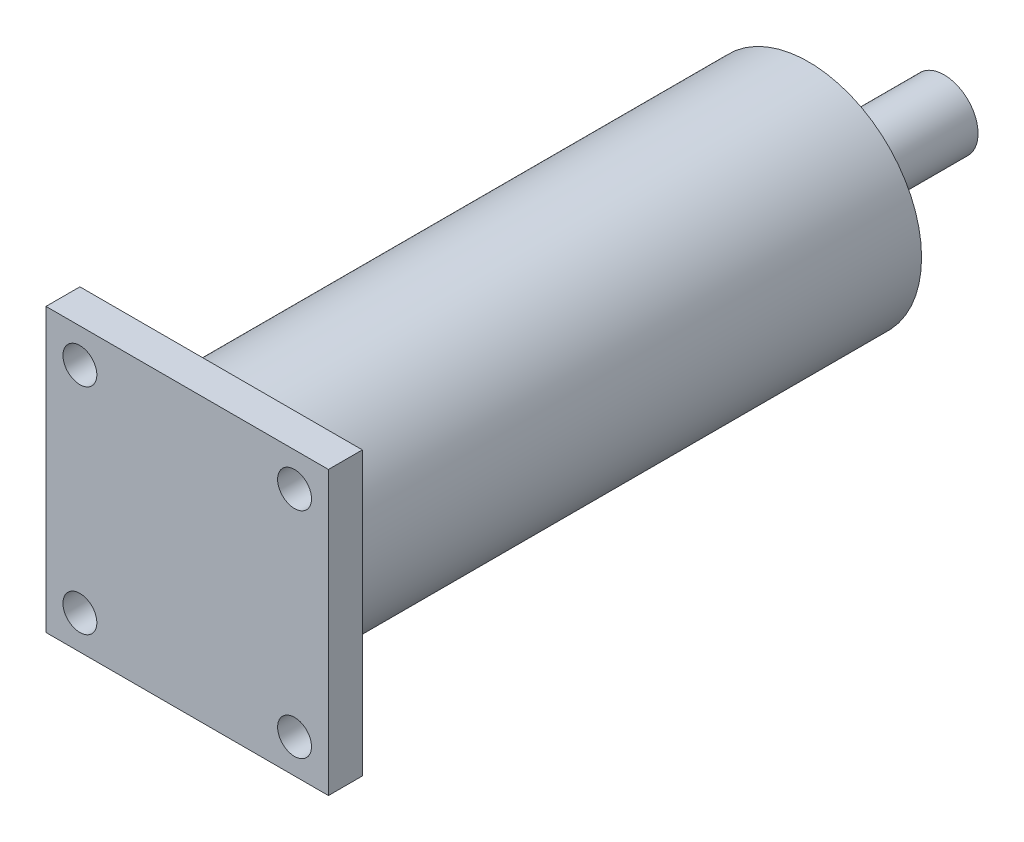
ISO-10303-21;
HEADER;
FILE_DESCRIPTION(('STEP AP214'),'2;1');
FILE_NAME('part.step','',(''),(''),'','','');
FILE_SCHEMA(('AUTOMOTIVE_DESIGN { 1 0 10303 214 1 1 1 1 }'));
ENDSEC;
DATA;
#1=APPLICATION_CONTEXT('core data for automotive mechanical design processes');
#2=APPLICATION_PROTOCOL_DEFINITION('international standard','automotive_design',2000,#1);
#3=PRODUCT_CONTEXT('',#1,'mechanical');
#4=PRODUCT('Part','Part','',(#3));
#5=PRODUCT_RELATED_PRODUCT_CATEGORY('part','',(#4));
#6=PRODUCT_DEFINITION_FORMATION('','',#4);
#7=PRODUCT_DEFINITION_CONTEXT('part definition',#1,'design');
#8=PRODUCT_DEFINITION('design','',#6,#7);
#9=PRODUCT_DEFINITION_SHAPE('','',#8);
#10=(LENGTH_UNIT() NAMED_UNIT(*) SI_UNIT(.MILLI.,.METRE.));
#11=(NAMED_UNIT(*) PLANE_ANGLE_UNIT() SI_UNIT($,.RADIAN.));
#12=(NAMED_UNIT(*) SI_UNIT($,.STERADIAN.) SOLID_ANGLE_UNIT());
#13=UNCERTAINTY_MEASURE_WITH_UNIT(LENGTH_MEASURE(1.E-05),#10,'distance_accuracy_value','');
#14=(GEOMETRIC_REPRESENTATION_CONTEXT(3) GLOBAL_UNCERTAINTY_ASSIGNED_CONTEXT((#13)) GLOBAL_UNIT_ASSIGNED_CONTEXT((#10,
#11,#12)) REPRESENTATION_CONTEXT('',''));
#15=CARTESIAN_POINT('',(0.,0.,0.));
#16=DIRECTION('',(0.,0.,1.));
#17=DIRECTION('',(1.,0.,0.));
#18=AXIS2_PLACEMENT_3D('',#15,#16,#17);
#19=CARTESIAN_POINT('',(0.,0.,3.));
#20=DIRECTION('',(1.,0.,0.));
#21=DIRECTION('',(0.,1.,0.));
#22=AXIS2_PLACEMENT_3D('',#19,#20,#21);
#23=PLANE('',#22);
#24=DIRECTION('',(0.,-1.,0.));
#25=VECTOR('',#24,1.);
#26=CARTESIAN_POINT('',(0.,0.,0.));
#27=LINE('',#26,#25);
#28=CARTESIAN_POINT('',(0.,0.,0.));
#29=VERTEX_POINT('',#28);
#30=CARTESIAN_POINT('',(0.,-25.,0.));
#31=VERTEX_POINT('',#30);
#32=EDGE_CURVE('E101',#29,#31,#27,.T.);
#33=ORIENTED_EDGE('',*,*,#32,.T.);
#34=DIRECTION('',(0.,0.,-1.));
#35=VECTOR('',#34,1.);
#36=CARTESIAN_POINT('',(0.,-25.,3.));
#37=LINE('',#36,#35);
#38=CARTESIAN_POINT('',(0.,-25.,3.));
#39=VERTEX_POINT('',#38);
#40=EDGE_CURVE('E38',#39,#31,#37,.T.);
#41=ORIENTED_EDGE('',*,*,#40,.F.);
#42=DIRECTION('',(0.,-1.,0.));
#43=VECTOR('',#42,1.);
#44=CARTESIAN_POINT('',(0.,0.,3.));
#45=LINE('',#44,#43);
#46=CARTESIAN_POINT('',(0.,0.,3.));
#47=VERTEX_POINT('',#46);
#48=EDGE_CURVE('E88',#47,#39,#45,.T.);
#49=ORIENTED_EDGE('',*,*,#48,.F.);
#50=DIRECTION('',(0.,0.,-1.));
#51=VECTOR('',#50,1.);
#52=CARTESIAN_POINT('',(0.,0.,3.));
#53=LINE('',#52,#51);
#54=EDGE_CURVE('E97',#47,#29,#53,.T.);
#55=ORIENTED_EDGE('',*,*,#54,.T.);
#56=EDGE_LOOP('',(#33,#41,#49,#55));
#57=FACE_BOUND('',#56,.T.);
#58=ADVANCED_FACE('F35',(#57),#23,.F.);
#59=CARTESIAN_POINT('',(0.,-25.,3.));
#60=DIRECTION('',(0.,1.,0.));
#61=DIRECTION('',(0.,0.,1.));
#62=AXIS2_PLACEMENT_3D('',#59,#60,#61);
#63=PLANE('',#62);
#64=DIRECTION('',(1.,0.,0.));
#65=VECTOR('',#64,1.);
#66=CARTESIAN_POINT('',(0.,-25.,0.));
#67=LINE('',#66,#65);
#68=CARTESIAN_POINT('',(25.,-25.,0.));
#69=VERTEX_POINT('',#68);
#70=EDGE_CURVE('E93',#31,#69,#67,.T.);
#71=ORIENTED_EDGE('',*,*,#70,.T.);
#72=DIRECTION('',(0.,0.,-1.));
#73=VECTOR('',#72,1.);
#74=CARTESIAN_POINT('',(25.,-25.,3.));
#75=LINE('',#74,#73);
#76=CARTESIAN_POINT('',(25.,-25.,3.));
#77=VERTEX_POINT('',#76);
#78=EDGE_CURVE('E91',#77,#69,#75,.T.);
#79=ORIENTED_EDGE('',*,*,#78,.F.);
#80=DIRECTION('',(1.,0.,0.));
#81=VECTOR('',#80,1.);
#82=CARTESIAN_POINT('',(0.,-25.,3.));
#83=LINE('',#82,#81);
#84=EDGE_CURVE('E83',#39,#77,#83,.T.);
#85=ORIENTED_EDGE('',*,*,#84,.F.);
#86=ORIENTED_EDGE('',*,*,#40,.T.);
#87=EDGE_LOOP('',(#71,#79,#85,#86));
#88=FACE_BOUND('',#87,.T.);
#89=ADVANCED_FACE('F92',(#88),#63,.F.);
#90=CARTESIAN_POINT('',(25.,0.,3.));
#91=DIRECTION('',(-1.,0.,0.));
#92=DIRECTION('',(0.,-1.,0.));
#93=AXIS2_PLACEMENT_3D('',#90,#91,#92);
#94=PLANE('',#93);
#95=DIRECTION('',(0.,1.,0.));
#96=VECTOR('',#95,1.);
#97=CARTESIAN_POINT('',(25.,0.,0.));
#98=LINE('',#97,#96);
#99=CARTESIAN_POINT('',(25.,0.,0.));
#100=VERTEX_POINT('',#99);
#101=EDGE_CURVE('E69',#69,#100,#98,.T.);
#102=ORIENTED_EDGE('',*,*,#101,.T.);
#103=DIRECTION('',(0.,0.,-1.));
#104=VECTOR('',#103,1.);
#105=CARTESIAN_POINT('',(25.,0.,3.));
#106=LINE('',#105,#104);
#107=CARTESIAN_POINT('',(25.,0.,3.));
#108=VERTEX_POINT('',#107);
#109=EDGE_CURVE('E94',#108,#100,#106,.T.);
#110=ORIENTED_EDGE('',*,*,#109,.F.);
#111=DIRECTION('',(0.,1.,0.));
#112=VECTOR('',#111,1.);
#113=CARTESIAN_POINT('',(25.,0.,3.));
#114=LINE('',#113,#112);
#115=EDGE_CURVE('E86',#77,#108,#114,.T.);
#116=ORIENTED_EDGE('',*,*,#115,.F.);
#117=ORIENTED_EDGE('',*,*,#78,.T.);
#118=EDGE_LOOP('',(#102,#110,#116,#117));
#119=FACE_BOUND('',#118,.T.);
#120=ADVANCED_FACE('F95',(#119),#94,.F.);
#121=CARTESIAN_POINT('',(0.,0.,3.));
#122=DIRECTION('',(0.,-1.,0.));
#123=DIRECTION('',(0.,0.,-1.));
#124=AXIS2_PLACEMENT_3D('',#121,#122,#123);
#125=PLANE('',#124);
#126=DIRECTION('',(-1.,0.,0.));
#127=VECTOR('',#126,1.);
#128=CARTESIAN_POINT('',(0.,0.,0.));
#129=LINE('',#128,#127);
#130=EDGE_CURVE('E75',#100,#29,#129,.T.);
#131=ORIENTED_EDGE('',*,*,#130,.T.);
#132=ORIENTED_EDGE('',*,*,#54,.F.);
#133=DIRECTION('',(-1.,0.,0.));
#134=VECTOR('',#133,1.);
#135=CARTESIAN_POINT('',(0.,0.,3.));
#136=LINE('',#135,#134);
#137=EDGE_CURVE('E52',#108,#47,#136,.T.);
#138=ORIENTED_EDGE('',*,*,#137,.F.);
#139=ORIENTED_EDGE('',*,*,#109,.T.);
#140=EDGE_LOOP('',(#131,#132,#138,#139));
#141=FACE_BOUND('',#140,.T.);
#142=ADVANCED_FACE('F109',(#141),#125,.F.);
#143=CARTESIAN_POINT('',(0.,0.,3.));
#144=DIRECTION('',(0.,0.,1.));
#145=DIRECTION('',(1.,0.,0.));
#146=AXIS2_PLACEMENT_3D('',#143,#144,#145);
#147=PLANE('',#146);
#148=CARTESIAN_POINT('',(22.,-22.,3.));
#149=DIRECTION('',(0.,0.,-1.));
#150=DIRECTION('',(1.,0.,0.));
#151=AXIS2_PLACEMENT_3D('',#148,#149,#150);
#152=CIRCLE('',#151,1.5);
#153=CARTESIAN_POINT('',(23.5,-22.,3.));
#154=VERTEX_POINT('',#153);
#155=EDGE_CURVE('E124',#154,#154,#152,.T.);
#156=ORIENTED_EDGE('',*,*,#155,.T.);
#157=EDGE_LOOP('',(#156));
#158=FACE_BOUND('',#157,.T.);
#159=CARTESIAN_POINT('',(3.,-22.,3.));
#160=DIRECTION('',(0.,0.,-1.));
#161=DIRECTION('',(-1.,0.,0.));
#162=AXIS2_PLACEMENT_3D('',#159,#160,#161);
#163=CIRCLE('',#162,1.5);
#164=CARTESIAN_POINT('',(1.49999999999999,-22.,3.));
#165=VERTEX_POINT('',#164);
#166=EDGE_CURVE('E131',#165,#165,#163,.T.);
#167=ORIENTED_EDGE('',*,*,#166,.T.);
#168=EDGE_LOOP('',(#167));
#169=FACE_BOUND('',#168,.T.);
#170=CARTESIAN_POINT('',(3.,-3.,3.));
#171=DIRECTION('',(0.,0.,-1.));
#172=DIRECTION('',(1.,0.,0.));
#173=AXIS2_PLACEMENT_3D('',#170,#171,#172);
#174=CIRCLE('',#173,1.5);
#175=CARTESIAN_POINT('',(4.5,-3.,3.));
#176=VERTEX_POINT('',#175);
#177=EDGE_CURVE('E118',#176,#176,#174,.T.);
#178=ORIENTED_EDGE('',*,*,#177,.T.);
#179=EDGE_LOOP('',(#178));
#180=FACE_BOUND('',#179,.T.);
#181=CARTESIAN_POINT('',(22.,-3.,3.));
#182=DIRECTION('',(0.,0.,-1.));
#183=DIRECTION('',(-1.,0.,0.));
#184=AXIS2_PLACEMENT_3D('',#181,#182,#183);
#185=CIRCLE('',#184,1.5);
#186=CARTESIAN_POINT('',(20.5,-3.,3.));
#187=VERTEX_POINT('',#186);
#188=EDGE_CURVE('E104',#187,#187,#185,.T.);
#189=ORIENTED_EDGE('',*,*,#188,.T.);
#190=EDGE_LOOP('',(#189));
#191=FACE_BOUND('',#190,.T.);
#192=ORIENTED_EDGE('',*,*,#48,.T.);
#193=ORIENTED_EDGE('',*,*,#84,.T.);
#194=ORIENTED_EDGE('',*,*,#115,.T.);
#195=ORIENTED_EDGE('',*,*,#137,.T.);
#196=EDGE_LOOP('',(#192,#193,#194,#195));
#197=FACE_BOUND('',#196,.T.);
#198=ADVANCED_FACE('F84',(#158,#169,#180,#191,#197),#147,.T.);
#199=CARTESIAN_POINT('',(0.,0.,0.));
#200=DIRECTION('',(0.,0.,1.));
#201=DIRECTION('',(1.,0.,0.));
#202=AXIS2_PLACEMENT_3D('',#199,#200,#201);
#203=PLANE('',#202);
#204=CARTESIAN_POINT('',(12.5,-12.5,0.));
#205=DIRECTION('',(0.,0.,1.));
#206=DIRECTION('',(1.,0.,0.));
#207=AXIS2_PLACEMENT_3D('',#204,#205,#206);
#208=CIRCLE('',#207,10.);
#209=CARTESIAN_POINT('',(22.5,-12.5,0.));
#210=VERTEX_POINT('',#209);
#211=EDGE_CURVE('E139',#210,#210,#208,.T.);
#212=ORIENTED_EDGE('',*,*,#211,.T.);
#213=EDGE_LOOP('',(#212));
#214=FACE_BOUND('',#213,.T.);
#215=CARTESIAN_POINT('',(22.,-22.,0.));
#216=DIRECTION('',(0.,0.,-1.));
#217=DIRECTION('',(1.,0.,0.));
#218=AXIS2_PLACEMENT_3D('',#215,#216,#217);
#219=CIRCLE('',#218,1.5);
#220=CARTESIAN_POINT('',(23.5,-22.,0.));
#221=VERTEX_POINT('',#220);
#222=EDGE_CURVE('E121',#221,#221,#219,.T.);
#223=ORIENTED_EDGE('',*,*,#222,.F.);
#224=EDGE_LOOP('',(#223));
#225=FACE_BOUND('',#224,.T.);
#226=CARTESIAN_POINT('',(3.,-22.,0.));
#227=DIRECTION('',(0.,0.,-1.));
#228=DIRECTION('',(-1.,0.,0.));
#229=AXIS2_PLACEMENT_3D('',#226,#227,#228);
#230=CIRCLE('',#229,1.5);
#231=CARTESIAN_POINT('',(1.49999999999999,-22.,0.));
#232=VERTEX_POINT('',#231);
#233=EDGE_CURVE('E128',#232,#232,#230,.T.);
#234=ORIENTED_EDGE('',*,*,#233,.F.);
#235=EDGE_LOOP('',(#234));
#236=FACE_BOUND('',#235,.T.);
#237=CARTESIAN_POINT('',(3.,-3.,0.));
#238=DIRECTION('',(0.,0.,-1.));
#239=DIRECTION('',(1.,0.,0.));
#240=AXIS2_PLACEMENT_3D('',#237,#238,#239);
#241=CIRCLE('',#240,1.5);
#242=CARTESIAN_POINT('',(4.5,-3.,0.));
#243=VERTEX_POINT('',#242);
#244=EDGE_CURVE('E134',#243,#243,#241,.T.);
#245=ORIENTED_EDGE('',*,*,#244,.F.);
#246=EDGE_LOOP('',(#245));
#247=FACE_BOUND('',#246,.T.);
#248=CARTESIAN_POINT('',(22.,-3.,0.));
#249=DIRECTION('',(0.,0.,-1.));
#250=DIRECTION('',(-1.,0.,0.));
#251=AXIS2_PLACEMENT_3D('',#248,#249,#250);
#252=CIRCLE('',#251,1.5);
#253=CARTESIAN_POINT('',(20.5,-3.,0.));
#254=VERTEX_POINT('',#253);
#255=EDGE_CURVE('E115',#254,#254,#252,.T.);
#256=ORIENTED_EDGE('',*,*,#255,.F.);
#257=EDGE_LOOP('',(#256));
#258=FACE_BOUND('',#257,.T.);
#259=ORIENTED_EDGE('',*,*,#32,.F.);
#260=ORIENTED_EDGE('',*,*,#130,.F.);
#261=ORIENTED_EDGE('',*,*,#101,.F.);
#262=ORIENTED_EDGE('',*,*,#70,.F.);
#263=EDGE_LOOP('',(#259,#260,#261,#262));
#264=FACE_BOUND('',#263,.T.);
#265=ADVANCED_FACE('F112',(#214,#225,#236,#247,#258,#264),#203,.F.);
#266=CARTESIAN_POINT('',(22.,-3.,3.));
#267=DIRECTION('',(0.,0.,-1.));
#268=DIRECTION('',(-1.,0.,0.));
#269=AXIS2_PLACEMENT_3D('',#266,#267,#268);
#270=CYLINDRICAL_SURFACE('',#269,1.5);
#271=ORIENTED_EDGE('',*,*,#188,.F.);
#272=EDGE_LOOP('',(#271));
#273=FACE_BOUND('',#272,.T.);
#274=ORIENTED_EDGE('',*,*,#255,.T.);
#275=EDGE_LOOP('',(#274));
#276=FACE_BOUND('',#275,.T.);
#277=ADVANCED_FACE('F171',(#273,#276),#270,.F.);
#278=CARTESIAN_POINT('',(3.,-3.,3.));
#279=DIRECTION('',(0.,0.,-1.));
#280=DIRECTION('',(-1.,0.,0.));
#281=AXIS2_PLACEMENT_3D('',#278,#279,#280);
#282=CYLINDRICAL_SURFACE('',#281,1.5);
#283=ORIENTED_EDGE('',*,*,#177,.F.);
#284=EDGE_LOOP('',(#283));
#285=FACE_BOUND('',#284,.T.);
#286=ORIENTED_EDGE('',*,*,#244,.T.);
#287=EDGE_LOOP('',(#286));
#288=FACE_BOUND('',#287,.T.);
#289=ADVANCED_FACE('F182',(#285,#288),#282,.F.);
#290=CARTESIAN_POINT('',(3.,-22.,3.));
#291=DIRECTION('',(0.,0.,-1.));
#292=DIRECTION('',(-1.,0.,0.));
#293=AXIS2_PLACEMENT_3D('',#290,#291,#292);
#294=CYLINDRICAL_SURFACE('',#293,1.5);
#295=ORIENTED_EDGE('',*,*,#166,.F.);
#296=EDGE_LOOP('',(#295));
#297=FACE_BOUND('',#296,.T.);
#298=ORIENTED_EDGE('',*,*,#233,.T.);
#299=EDGE_LOOP('',(#298));
#300=FACE_BOUND('',#299,.T.);
#301=ADVANCED_FACE('F188',(#297,#300),#294,.F.);
#302=CARTESIAN_POINT('',(22.,-22.,3.));
#303=DIRECTION('',(0.,0.,-1.));
#304=DIRECTION('',(-1.,0.,0.));
#305=AXIS2_PLACEMENT_3D('',#302,#303,#304);
#306=CYLINDRICAL_SURFACE('',#305,1.5);
#307=ORIENTED_EDGE('',*,*,#155,.F.);
#308=EDGE_LOOP('',(#307));
#309=FACE_BOUND('',#308,.T.);
#310=ORIENTED_EDGE('',*,*,#222,.T.);
#311=EDGE_LOOP('',(#310));
#312=FACE_BOUND('',#311,.T.);
#313=ADVANCED_FACE('F165',(#309,#312),#306,.F.);
#314=CARTESIAN_POINT('',(12.5,-12.5,-52.));
#315=DIRECTION('',(0.,0.,1.));
#316=DIRECTION('',(1.,0.,0.));
#317=AXIS2_PLACEMENT_3D('',#314,#315,#316);
#318=CYLINDRICAL_SURFACE('',#317,10.);
#319=CARTESIAN_POINT('',(12.5,-12.5,-52.));
#320=DIRECTION('',(0.,0.,1.));
#321=DIRECTION('',(1.,0.,0.));
#322=AXIS2_PLACEMENT_3D('',#319,#320,#321);
#323=CIRCLE('',#322,10.);
#324=CARTESIAN_POINT('',(22.5,-12.5,-52.));
#325=VERTEX_POINT('',#324);
#326=EDGE_CURVE('E125',#325,#325,#323,.T.);
#327=ORIENTED_EDGE('',*,*,#326,.T.);
#328=EDGE_LOOP('',(#327));
#329=FACE_BOUND('',#328,.T.);
#330=ORIENTED_EDGE('',*,*,#211,.F.);
#331=EDGE_LOOP('',(#330));
#332=FACE_BOUND('',#331,.T.);
#333=ADVANCED_FACE('F159',(#329,#332),#318,.T.);
#334=CARTESIAN_POINT('',(12.5,-12.5,-52.));
#335=DIRECTION('',(0.,0.,1.));
#336=DIRECTION('',(1.,0.,0.));
#337=AXIS2_PLACEMENT_3D('',#334,#335,#336);
#338=PLANE('',#337);
#339=CARTESIAN_POINT('',(12.5,-12.5,-52.));
#340=DIRECTION('',(0.,0.,-1.));
#341=DIRECTION('',(-1.,0.,0.));
#342=AXIS2_PLACEMENT_3D('',#339,#340,#341);
#343=CIRCLE('',#342,3.);
#344=CARTESIAN_POINT('',(9.5,-12.5,-52.));
#345=VERTEX_POINT('',#344);
#346=EDGE_CURVE('E11',#345,#345,#343,.T.);
#347=ORIENTED_EDGE('',*,*,#346,.F.);
#348=EDGE_LOOP('',(#347));
#349=FACE_BOUND('',#348,.T.);
#350=ORIENTED_EDGE('',*,*,#326,.F.);
#351=EDGE_LOOP('',(#350));
#352=FACE_BOUND('',#351,.T.);
#353=ADVANCED_FACE('F153',(#349,#352),#338,.F.);
#354=CARTESIAN_POINT('',(12.5,-12.5,-64.));
#355=DIRECTION('',(0.,0.,1.));
#356=DIRECTION('',(1.,0.,0.));
#357=AXIS2_PLACEMENT_3D('',#354,#355,#356);
#358=CYLINDRICAL_SURFACE('',#357,3.);
#359=CARTESIAN_POINT('',(12.5,-12.5,-64.));
#360=DIRECTION('',(0.,0.,-1.));
#361=DIRECTION('',(-1.,0.,0.));
#362=AXIS2_PLACEMENT_3D('',#359,#360,#361);
#363=CIRCLE('',#362,3.);
#364=CARTESIAN_POINT('',(9.5,-12.5,-64.));
#365=VERTEX_POINT('',#364);
#366=EDGE_CURVE('E142',#365,#365,#363,.T.);
#367=ORIENTED_EDGE('',*,*,#366,.F.);
#368=EDGE_LOOP('',(#367));
#369=FACE_BOUND('',#368,.T.);
#370=ORIENTED_EDGE('',*,*,#346,.T.);
#371=EDGE_LOOP('',(#370));
#372=FACE_BOUND('',#371,.T.);
#373=ADVANCED_FACE('F150',(#369,#372),#358,.T.);
#374=CARTESIAN_POINT('',(12.5,-12.5,-64.));
#375=DIRECTION('',(0.,0.,-1.));
#376=DIRECTION('',(-1.,0.,0.));
#377=AXIS2_PLACEMENT_3D('',#374,#375,#376);
#378=PLANE('',#377);
#379=ORIENTED_EDGE('',*,*,#366,.T.);
#380=EDGE_LOOP('',(#379));
#381=FACE_BOUND('',#380,.T.);
#382=ADVANCED_FACE('F148',(#381),#378,.T.);
#383=CLOSED_SHELL('',(#58,#89,#120,#142,#198,#265,#277,#289,#301,#313,#333,#353,#373,#382));
#384=MANIFOLD_SOLID_BREP('B2',#383);
#385=ADVANCED_BREP_SHAPE_REPRESENTATION('',(#18,#384),#14);
#386=SHAPE_DEFINITION_REPRESENTATION(#9,#385);
ENDSEC;
END-ISO-10303-21;
